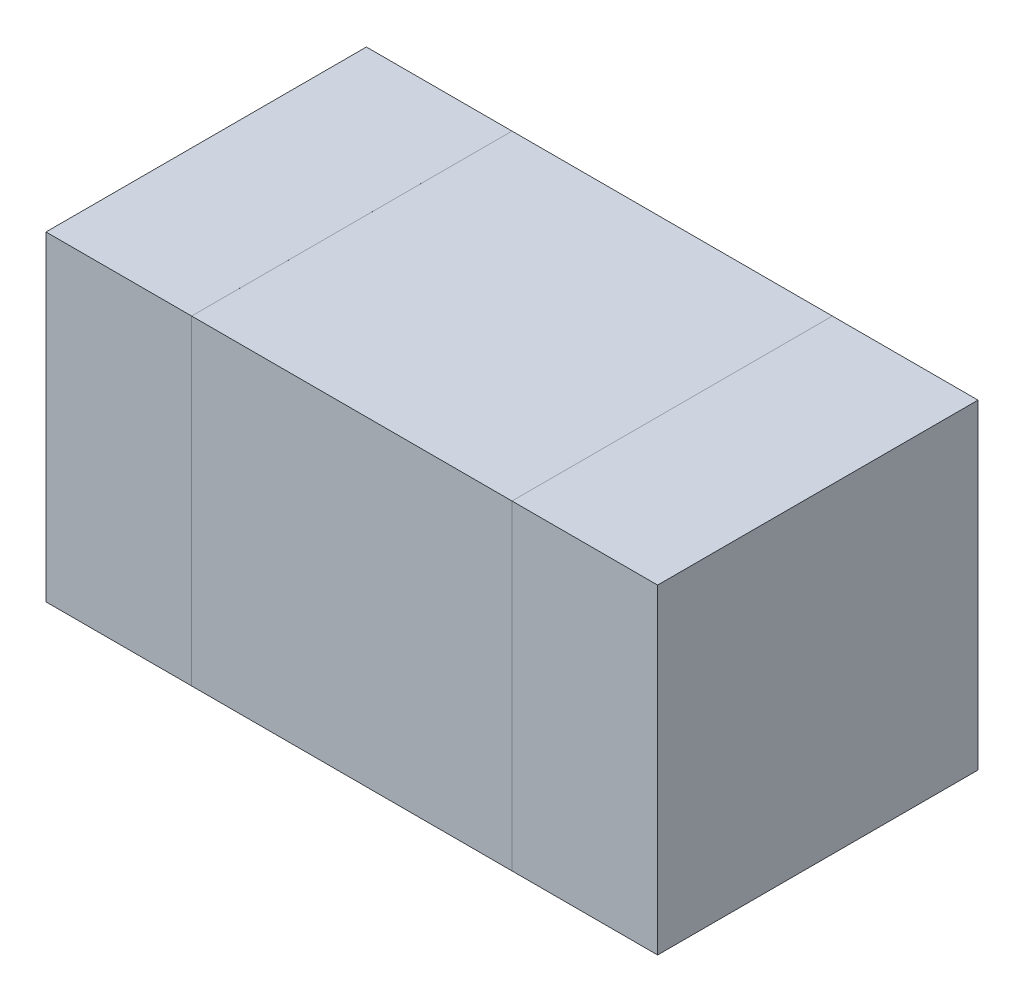
ISO-10303-21;
HEADER;
FILE_DESCRIPTION(('STEP AP214'),'2;1');
FILE_NAME('part.step','',(''),(''),'','','');
FILE_SCHEMA(('AUTOMOTIVE_DESIGN { 1 0 10303 214 1 1 1 1 }'));
ENDSEC;
DATA;
#1=APPLICATION_CONTEXT('core data for automotive mechanical design processes');
#2=APPLICATION_PROTOCOL_DEFINITION('international standard','automotive_design',2000,#1);
#3=PRODUCT_CONTEXT('',#1,'mechanical');
#4=PRODUCT('Part','Part','',(#3));
#5=PRODUCT_RELATED_PRODUCT_CATEGORY('part','',(#4));
#6=PRODUCT_DEFINITION_FORMATION('','',#4);
#7=PRODUCT_DEFINITION_CONTEXT('part definition',#1,'design');
#8=PRODUCT_DEFINITION('design','',#6,#7);
#9=PRODUCT_DEFINITION_SHAPE('','',#8);
#10=(LENGTH_UNIT() NAMED_UNIT(*) SI_UNIT(.MILLI.,.METRE.));
#11=(NAMED_UNIT(*) PLANE_ANGLE_UNIT() SI_UNIT($,.RADIAN.));
#12=(NAMED_UNIT(*) SI_UNIT($,.STERADIAN.) SOLID_ANGLE_UNIT());
#13=UNCERTAINTY_MEASURE_WITH_UNIT(LENGTH_MEASURE(1.E-05),#10,'distance_accuracy_value','');
#14=(GEOMETRIC_REPRESENTATION_CONTEXT(3) GLOBAL_UNCERTAINTY_ASSIGNED_CONTEXT((#13)) GLOBAL_UNIT_ASSIGNED_CONTEXT((#10,
#11,#12)) REPRESENTATION_CONTEXT('',''));
#15=CARTESIAN_POINT('',(0.,0.,0.));
#16=DIRECTION('',(0.,0.,1.));
#17=DIRECTION('',(1.,0.,0.));
#18=AXIS2_PLACEMENT_3D('',#15,#16,#17);
#19=CARTESIAN_POINT('',(9.060006232969,9.285003011953,0.32999934));
#20=DIRECTION('',(0.,0.,-1.));
#21=DIRECTION('',(0.,-1.,0.));
#22=AXIS2_PLACEMENT_3D('',#19,#20,#21);
#23=PLANE('',#22);
#24=DIRECTION('',(1.,0.,0.));
#25=VECTOR('',#24,1.);
#26=CARTESIAN_POINT('',(9.060006232969,9.285003011953,0.32999934));
#27=LINE('',#26,#25);
#28=CARTESIAN_POINT('',(9.060006232969,9.285003011953,0.32999934));
#29=VERTEX_POINT('',#28);
#30=CARTESIAN_POINT('',(9.390008112969,9.285003011953,0.32999934));
#31=VERTEX_POINT('',#30);
#32=EDGE_CURVE('P0_E90',#29,#31,#27,.T.);
#33=ORIENTED_EDGE('',*,*,#32,.T.);
#34=DIRECTION('',(0.,1.,0.));
#35=VECTOR('',#34,1.);
#36=CARTESIAN_POINT('',(9.390008112969,9.285003011953,0.32999934));
#37=LINE('',#36,#35);
#38=CARTESIAN_POINT('',(9.390008112969,9.615002351953,0.32999934));
#39=VERTEX_POINT('',#38);
#40=EDGE_CURVE('P0_E109',#31,#39,#37,.T.);
#41=ORIENTED_EDGE('',*,*,#40,.T.);
#42=DIRECTION('',(-1.,0.,0.));
#43=VECTOR('',#42,1.);
#44=CARTESIAN_POINT('',(9.390008112969,9.615002351953,0.32999934));
#45=LINE('',#44,#43);
#46=CARTESIAN_POINT('',(9.060006232969,9.615002351953,0.32999934));
#47=VERTEX_POINT('',#46);
#48=EDGE_CURVE('P0_E84',#39,#47,#45,.T.);
#49=ORIENTED_EDGE('',*,*,#48,.T.);
#50=DIRECTION('',(0.,-1.,0.));
#51=VECTOR('',#50,1.);
#52=CARTESIAN_POINT('',(9.060006232969,9.615002351953,0.32999934));
#53=LINE('',#52,#51);
#54=EDGE_CURVE('P0_E11',#47,#29,#53,.T.);
#55=ORIENTED_EDGE('',*,*,#54,.T.);
#56=EDGE_LOOP('',(#33,#41,#49,#55));
#57=FACE_BOUND('',#56,.T.);
#58=ADVANCED_FACE('P0_F17',(#57),#23,.F.);
#59=CARTESIAN_POINT('',(9.060006232969,9.285003011953,0.));
#60=DIRECTION('',(0.,0.,-1.));
#61=DIRECTION('',(0.,-1.,0.));
#62=AXIS2_PLACEMENT_3D('',#59,#60,#61);
#63=PLANE('',#62);
#64=DIRECTION('',(0.,-1.,0.));
#65=VECTOR('',#64,1.);
#66=CARTESIAN_POINT('',(9.060006232969,9.615002351953,0.));
#67=LINE('',#66,#65);
#68=CARTESIAN_POINT('',(9.060006232969,9.615002351953,0.));
#69=VERTEX_POINT('',#68);
#70=CARTESIAN_POINT('',(9.060006232969,9.285003011953,0.));
#71=VERTEX_POINT('',#70);
#72=EDGE_CURVE('P0_E25',#69,#71,#67,.T.);
#73=ORIENTED_EDGE('',*,*,#72,.F.);
#74=DIRECTION('',(-1.,0.,0.));
#75=VECTOR('',#74,1.);
#76=CARTESIAN_POINT('',(9.390008112969,9.615002351953,0.));
#77=LINE('',#76,#75);
#78=CARTESIAN_POINT('',(9.390008112969,9.615002351953,0.));
#79=VERTEX_POINT('',#78);
#80=EDGE_CURVE('P0_E63',#79,#69,#77,.T.);
#81=ORIENTED_EDGE('',*,*,#80,.F.);
#82=DIRECTION('',(0.,1.,0.));
#83=VECTOR('',#82,1.);
#84=CARTESIAN_POINT('',(9.390008112969,9.285003011953,0.));
#85=LINE('',#84,#83);
#86=CARTESIAN_POINT('',(9.390008112969,9.285003011953,0.));
#87=VERTEX_POINT('',#86);
#88=EDGE_CURVE('P0_E74',#87,#79,#85,.T.);
#89=ORIENTED_EDGE('',*,*,#88,.F.);
#90=DIRECTION('',(1.,0.,0.));
#91=VECTOR('',#90,1.);
#92=CARTESIAN_POINT('',(9.060006232969,9.285003011953,0.));
#93=LINE('',#92,#91);
#94=EDGE_CURVE('P0_E89',#71,#87,#93,.T.);
#95=ORIENTED_EDGE('',*,*,#94,.F.);
#96=EDGE_LOOP('',(#73,#81,#89,#95));
#97=FACE_BOUND('',#96,.T.);
#98=ADVANCED_FACE('P0_F93',(#97),#63,.T.);
#99=CARTESIAN_POINT('',(9.060006232969,9.615002351953,0.));
#100=DIRECTION('',(1.,0.,0.));
#101=DIRECTION('',(0.,1.,0.));
#102=AXIS2_PLACEMENT_3D('',#99,#100,#101);
#103=PLANE('',#102);
#104=ORIENTED_EDGE('',*,*,#72,.T.);
#105=DIRECTION('',(0.,0.,1.));
#106=VECTOR('',#105,1.);
#107=CARTESIAN_POINT('',(9.060006232969,9.285003011953,0.));
#108=LINE('',#107,#106);
#109=EDGE_CURVE('P0_E79',#71,#29,#108,.T.);
#110=ORIENTED_EDGE('',*,*,#109,.T.);
#111=ORIENTED_EDGE('',*,*,#54,.F.);
#112=DIRECTION('',(0.,0.,1.));
#113=VECTOR('',#112,1.);
#114=CARTESIAN_POINT('',(9.060006232969,9.615002351953,0.));
#115=LINE('',#114,#113);
#116=EDGE_CURVE('P0_E82',#69,#47,#115,.T.);
#117=ORIENTED_EDGE('',*,*,#116,.F.);
#118=EDGE_LOOP('',(#104,#110,#111,#117));
#119=FACE_BOUND('',#118,.T.);
#120=ADVANCED_FACE('P0_F78',(#119),#103,.F.);
#121=CARTESIAN_POINT('',(9.390008112969,9.615002351953,0.));
#122=DIRECTION('',(0.,-1.,0.));
#123=DIRECTION('',(0.,0.,-1.));
#124=AXIS2_PLACEMENT_3D('',#121,#122,#123);
#125=PLANE('',#124);
#126=ORIENTED_EDGE('',*,*,#80,.T.);
#127=ORIENTED_EDGE('',*,*,#116,.T.);
#128=ORIENTED_EDGE('',*,*,#48,.F.);
#129=DIRECTION('',(0.,0.,1.));
#130=VECTOR('',#129,1.);
#131=CARTESIAN_POINT('',(9.390008112969,9.615002351953,0.));
#132=LINE('',#131,#130);
#133=EDGE_CURVE('P0_E105',#79,#39,#132,.T.);
#134=ORIENTED_EDGE('',*,*,#133,.F.);
#135=EDGE_LOOP('',(#126,#127,#128,#134));
#136=FACE_BOUND('',#135,.T.);
#137=ADVANCED_FACE('P0_F120',(#136),#125,.F.);
#138=CARTESIAN_POINT('',(9.390008112969,9.285003011953,0.));
#139=DIRECTION('',(-1.,0.,0.));
#140=DIRECTION('',(0.,0.,1.));
#141=AXIS2_PLACEMENT_3D('',#138,#139,#140);
#142=PLANE('',#141);
#143=ORIENTED_EDGE('',*,*,#88,.T.);
#144=ORIENTED_EDGE('',*,*,#133,.T.);
#145=ORIENTED_EDGE('',*,*,#40,.F.);
#146=DIRECTION('',(0.,0.,1.));
#147=VECTOR('',#146,1.);
#148=CARTESIAN_POINT('',(9.390008112969,9.285003011953,0.));
#149=LINE('',#148,#147);
#150=EDGE_CURVE('P0_E95',#87,#31,#149,.T.);
#151=ORIENTED_EDGE('',*,*,#150,.F.);
#152=EDGE_LOOP('',(#143,#144,#145,#151));
#153=FACE_BOUND('',#152,.T.);
#154=ADVANCED_FACE('P0_F122',(#153),#142,.F.);
#155=CARTESIAN_POINT('',(9.060006232969,9.285003011953,0.));
#156=DIRECTION('',(0.,1.,0.));
#157=DIRECTION('',(1.,0.,0.));
#158=AXIS2_PLACEMENT_3D('',#155,#156,#157);
#159=PLANE('',#158);
#160=ORIENTED_EDGE('',*,*,#94,.T.);
#161=ORIENTED_EDGE('',*,*,#150,.T.);
#162=ORIENTED_EDGE('',*,*,#32,.F.);
#163=ORIENTED_EDGE('',*,*,#109,.F.);
#164=EDGE_LOOP('',(#160,#161,#162,#163));
#165=FACE_BOUND('',#164,.T.);
#166=ADVANCED_FACE('P0_F87',(#165),#159,.F.);
#167=CLOSED_SHELL('',(#58,#98,#120,#137,#154,#166));
#168=MANIFOLD_SOLID_BREP('P0_B1',#167);
#169=CARTESIAN_POINT('',(9.060002799805,9.285000471953,0.32999934));
#170=DIRECTION('',(0.,0.,-1.));
#171=DIRECTION('',(0.,-1.,0.));
#172=AXIS2_PLACEMENT_3D('',#169,#170,#171);
#173=PLANE('',#172);
#174=DIRECTION('',(0.,1.,0.));
#175=VECTOR('',#174,1.);
#176=CARTESIAN_POINT('',(9.060002799805,9.285000471953,0.32999934));
#177=LINE('',#176,#175);
#178=CARTESIAN_POINT('',(9.060002799805,9.285000471953,0.32999934));
#179=VERTEX_POINT('',#178);
#180=CARTESIAN_POINT('',(9.060002799805,9.615002351953,0.32999934));
#181=VERTEX_POINT('',#180);
#182=EDGE_CURVE('P1_E81',#179,#181,#177,.T.);
#183=ORIENTED_EDGE('',*,*,#182,.T.);
#184=DIRECTION('',(-1.,0.,0.));
#185=VECTOR('',#184,1.);
#186=CARTESIAN_POINT('',(9.060002799805,9.615002351953,0.32999934));
#187=LINE('',#186,#185);
#188=CARTESIAN_POINT('',(8.910000559805,9.615002351953,0.32999934));
#189=VERTEX_POINT('',#188);
#190=EDGE_CURVE('P1_E79',#181,#189,#187,.T.);
#191=ORIENTED_EDGE('',*,*,#190,.T.);
#192=DIRECTION('',(0.,-1.,0.));
#193=VECTOR('',#192,1.);
#194=CARTESIAN_POINT('',(8.910000559805,9.615002351953,0.32999934));
#195=LINE('',#194,#193);
#196=CARTESIAN_POINT('',(8.910000559805,9.285000471953,0.32999934));
#197=VERTEX_POINT('',#196);
#198=EDGE_CURVE('P1_E68',#189,#197,#195,.T.);
#199=ORIENTED_EDGE('',*,*,#198,.T.);
#200=DIRECTION('',(1.,0.,0.));
#201=VECTOR('',#200,1.);
#202=CARTESIAN_POINT('',(8.910000559805,9.285000471953,0.32999934));
#203=LINE('',#202,#201);
#204=EDGE_CURVE('P1_E11',#197,#179,#203,.T.);
#205=ORIENTED_EDGE('',*,*,#204,.T.);
#206=EDGE_LOOP('',(#183,#191,#199,#205));
#207=FACE_BOUND('',#206,.T.);
#208=ADVANCED_FACE('P1_F17',(#207),#173,.F.);
#209=CARTESIAN_POINT('',(9.060002799805,9.285000471953,0.));
#210=DIRECTION('',(0.,0.,-1.));
#211=DIRECTION('',(0.,-1.,0.));
#212=AXIS2_PLACEMENT_3D('',#209,#210,#211);
#213=PLANE('',#212);
#214=DIRECTION('',(1.,0.,0.));
#215=VECTOR('',#214,1.);
#216=CARTESIAN_POINT('',(8.910000559805,9.285000471953,0.));
#217=LINE('',#216,#215);
#218=CARTESIAN_POINT('',(8.910000559805,9.285000471953,0.));
#219=VERTEX_POINT('',#218);
#220=CARTESIAN_POINT('',(9.060002799805,9.285000471953,0.));
#221=VERTEX_POINT('',#220);
#222=EDGE_CURVE('P1_E21',#219,#221,#217,.T.);
#223=ORIENTED_EDGE('',*,*,#222,.F.);
#224=DIRECTION('',(0.,-1.,0.));
#225=VECTOR('',#224,1.);
#226=CARTESIAN_POINT('',(8.910000559805,9.615002351953,0.));
#227=LINE('',#226,#225);
#228=CARTESIAN_POINT('',(8.910000559805,9.615002351953,0.));
#229=VERTEX_POINT('',#228);
#230=EDGE_CURVE('P1_E61',#229,#219,#227,.T.);
#231=ORIENTED_EDGE('',*,*,#230,.F.);
#232=DIRECTION('',(-1.,0.,0.));
#233=VECTOR('',#232,1.);
#234=CARTESIAN_POINT('',(9.060002799805,9.615002351953,0.));
#235=LINE('',#234,#233);
#236=CARTESIAN_POINT('',(9.060002799805,9.615002351953,0.));
#237=VERTEX_POINT('',#236);
#238=EDGE_CURVE('P1_E88',#237,#229,#235,.T.);
#239=ORIENTED_EDGE('',*,*,#238,.F.);
#240=DIRECTION('',(0.,1.,0.));
#241=VECTOR('',#240,1.);
#242=CARTESIAN_POINT('',(9.060002799805,9.285000471953,0.));
#243=LINE('',#242,#241);
#244=EDGE_CURVE('P1_E150',#221,#237,#243,.T.);
#245=ORIENTED_EDGE('',*,*,#244,.F.);
#246=EDGE_LOOP('',(#223,#231,#239,#245));
#247=FACE_BOUND('',#246,.T.);
#248=ADVANCED_FACE('P1_F19',(#247),#213,.T.);
#249=CARTESIAN_POINT('',(8.910000559805,9.285000471953,0.));
#250=DIRECTION('',(0.,1.,0.));
#251=DIRECTION('',(1.,0.,0.));
#252=AXIS2_PLACEMENT_3D('',#249,#250,#251);
#253=PLANE('',#252);
#254=ORIENTED_EDGE('',*,*,#222,.T.);
#255=DIRECTION('',(0.,0.,1.));
#256=VECTOR('',#255,1.);
#257=CARTESIAN_POINT('',(9.060002799805,9.285000471953,0.));
#258=LINE('',#257,#256);
#259=EDGE_CURVE('P1_E94',#221,#179,#258,.T.);
#260=ORIENTED_EDGE('',*,*,#259,.T.);
#261=ORIENTED_EDGE('',*,*,#204,.F.);
#262=DIRECTION('',(0.,0.,1.));
#263=VECTOR('',#262,1.);
#264=CARTESIAN_POINT('',(8.910000559805,9.285000471953,0.));
#265=LINE('',#264,#263);
#266=EDGE_CURVE('P1_E74',#219,#197,#265,.T.);
#267=ORIENTED_EDGE('',*,*,#266,.F.);
#268=EDGE_LOOP('',(#254,#260,#261,#267));
#269=FACE_BOUND('',#268,.T.);
#270=ADVANCED_FACE('P1_F132',(#269),#253,.F.);
#271=CARTESIAN_POINT('',(8.910000559805,9.615002351953,0.));
#272=DIRECTION('',(1.,0.,0.));
#273=DIRECTION('',(0.,1.,0.));
#274=AXIS2_PLACEMENT_3D('',#271,#272,#273);
#275=PLANE('',#274);
#276=ORIENTED_EDGE('',*,*,#230,.T.);
#277=ORIENTED_EDGE('',*,*,#266,.T.);
#278=ORIENTED_EDGE('',*,*,#198,.F.);
#279=DIRECTION('',(0.,0.,1.));
#280=VECTOR('',#279,1.);
#281=CARTESIAN_POINT('',(8.910000559805,9.615002351953,0.));
#282=LINE('',#281,#280);
#283=EDGE_CURVE('P1_E72',#229,#189,#282,.T.);
#284=ORIENTED_EDGE('',*,*,#283,.F.);
#285=EDGE_LOOP('',(#276,#277,#278,#284));
#286=FACE_BOUND('',#285,.T.);
#287=ADVANCED_FACE('P1_F70',(#286),#275,.F.);
#288=CARTESIAN_POINT('',(9.060002799805,9.615002351953,0.));
#289=DIRECTION('',(0.,-1.,0.));
#290=DIRECTION('',(0.,0.,-1.));
#291=AXIS2_PLACEMENT_3D('',#288,#289,#290);
#292=PLANE('',#291);
#293=ORIENTED_EDGE('',*,*,#238,.T.);
#294=ORIENTED_EDGE('',*,*,#283,.T.);
#295=ORIENTED_EDGE('',*,*,#190,.F.);
#296=DIRECTION('',(0.,0.,1.));
#297=VECTOR('',#296,1.);
#298=CARTESIAN_POINT('',(9.060002799805,9.615002351953,0.));
#299=LINE('',#298,#297);
#300=EDGE_CURVE('P1_E151',#237,#181,#299,.T.);
#301=ORIENTED_EDGE('',*,*,#300,.F.);
#302=EDGE_LOOP('',(#293,#294,#295,#301));
#303=FACE_BOUND('',#302,.T.);
#304=ADVANCED_FACE('P1_F87',(#303),#292,.F.);
#305=CARTESIAN_POINT('',(9.060002799805,9.285000471953,0.));
#306=DIRECTION('',(-1.,0.,0.));
#307=DIRECTION('',(0.,0.,1.));
#308=AXIS2_PLACEMENT_3D('',#305,#306,#307);
#309=PLANE('',#308);
#310=ORIENTED_EDGE('',*,*,#244,.T.);
#311=ORIENTED_EDGE('',*,*,#300,.T.);
#312=ORIENTED_EDGE('',*,*,#182,.F.);
#313=ORIENTED_EDGE('',*,*,#259,.F.);
#314=EDGE_LOOP('',(#310,#311,#312,#313));
#315=FACE_BOUND('',#314,.T.);
#316=ADVANCED_FACE('P1_F107',(#315),#309,.F.);
#317=CLOSED_SHELL('',(#208,#248,#270,#287,#304,#316));
#318=MANIFOLD_SOLID_BREP('P1_B1',#317);
#319=CARTESIAN_POINT('',(9.539998527344,9.285000471953,0.32999934));
#320=DIRECTION('',(0.,0.,-1.));
#321=DIRECTION('',(0.,-1.,0.));
#322=AXIS2_PLACEMENT_3D('',#319,#320,#321);
#323=PLANE('',#322);
#324=DIRECTION('',(0.,1.,0.));
#325=VECTOR('',#324,1.);
#326=CARTESIAN_POINT('',(9.539998527344,9.285000471953,0.32999934));
#327=LINE('',#326,#325);
#328=CARTESIAN_POINT('',(9.539998527344,9.285000471953,0.32999934));
#329=VERTEX_POINT('',#328);
#330=CARTESIAN_POINT('',(9.539998527344,9.615002351953,0.32999934));
#331=VERTEX_POINT('',#330);
#332=EDGE_CURVE('P2_E83',#329,#331,#327,.T.);
#333=ORIENTED_EDGE('',*,*,#332,.T.);
#334=DIRECTION('',(-1.,0.,0.));
#335=VECTOR('',#334,1.);
#336=CARTESIAN_POINT('',(9.539998527344,9.615002351953,0.32999934));
#337=LINE('',#336,#335);
#338=CARTESIAN_POINT('',(9.389996287344,9.615002351953,0.32999934));
#339=VERTEX_POINT('',#338);
#340=EDGE_CURVE('P2_E104',#331,#339,#337,.T.);
#341=ORIENTED_EDGE('',*,*,#340,.T.);
#342=DIRECTION('',(0.,-1.,0.));
#343=VECTOR('',#342,1.);
#344=CARTESIAN_POINT('',(9.389996287344,9.615002351953,0.32999934));
#345=LINE('',#344,#343);
#346=CARTESIAN_POINT('',(9.389996287344,9.285000471953,0.32999934));
#347=VERTEX_POINT('',#346);
#348=EDGE_CURVE('P2_E20',#339,#347,#345,.T.);
#349=ORIENTED_EDGE('',*,*,#348,.T.);
#350=DIRECTION('',(1.,0.,0.));
#351=VECTOR('',#350,1.);
#352=CARTESIAN_POINT('',(9.389996287344,9.285000471953,0.32999934));
#353=LINE('',#352,#351);
#354=EDGE_CURVE('P2_E11',#347,#329,#353,.T.);
#355=ORIENTED_EDGE('',*,*,#354,.T.);
#356=EDGE_LOOP('',(#333,#341,#349,#355));
#357=FACE_BOUND('',#356,.T.);
#358=ADVANCED_FACE('P2_F17',(#357),#323,.F.);
#359=CARTESIAN_POINT('',(9.539998527344,9.285000471953,0.));
#360=DIRECTION('',(0.,0.,-1.));
#361=DIRECTION('',(0.,-1.,0.));
#362=AXIS2_PLACEMENT_3D('',#359,#360,#361);
#363=PLANE('',#362);
#364=DIRECTION('',(1.,0.,0.));
#365=VECTOR('',#364,1.);
#366=CARTESIAN_POINT('',(9.389996287344,9.285000471953,0.));
#367=LINE('',#366,#365);
#368=CARTESIAN_POINT('',(9.389996287344,9.285000471953,0.));
#369=VERTEX_POINT('',#368);
#370=CARTESIAN_POINT('',(9.539998527344,9.285000471953,0.));
#371=VERTEX_POINT('',#370);
#372=EDGE_CURVE('P2_E26',#369,#371,#367,.T.);
#373=ORIENTED_EDGE('',*,*,#372,.F.);
#374=DIRECTION('',(0.,-1.,0.));
#375=VECTOR('',#374,1.);
#376=CARTESIAN_POINT('',(9.389996287344,9.615002351953,0.));
#377=LINE('',#376,#375);
#378=CARTESIAN_POINT('',(9.389996287344,9.615002351953,0.));
#379=VERTEX_POINT('',#378);
#380=EDGE_CURVE('P2_E101',#379,#369,#377,.T.);
#381=ORIENTED_EDGE('',*,*,#380,.F.);
#382=DIRECTION('',(-1.,0.,0.));
#383=VECTOR('',#382,1.);
#384=CARTESIAN_POINT('',(9.539998527344,9.615002351953,0.));
#385=LINE('',#384,#383);
#386=CARTESIAN_POINT('',(9.539998527344,9.615002351953,0.));
#387=VERTEX_POINT('',#386);
#388=EDGE_CURVE('P2_E85',#387,#379,#385,.T.);
#389=ORIENTED_EDGE('',*,*,#388,.F.);
#390=DIRECTION('',(0.,1.,0.));
#391=VECTOR('',#390,1.);
#392=CARTESIAN_POINT('',(9.539998527344,9.285000471953,0.));
#393=LINE('',#392,#391);
#394=EDGE_CURVE('P2_E81',#371,#387,#393,.T.);
#395=ORIENTED_EDGE('',*,*,#394,.F.);
#396=EDGE_LOOP('',(#373,#381,#389,#395));
#397=FACE_BOUND('',#396,.T.);
#398=ADVANCED_FACE('P2_F87',(#397),#363,.T.);
#399=CARTESIAN_POINT('',(9.389996287344,9.285000471953,0.));
#400=DIRECTION('',(0.,1.,0.));
#401=DIRECTION('',(1.,0.,0.));
#402=AXIS2_PLACEMENT_3D('',#399,#400,#401);
#403=PLANE('',#402);
#404=ORIENTED_EDGE('',*,*,#372,.T.);
#405=DIRECTION('',(0.,0.,1.));
#406=VECTOR('',#405,1.);
#407=CARTESIAN_POINT('',(9.539998527344,9.285000471953,0.));
#408=LINE('',#407,#406);
#409=EDGE_CURVE('P2_E70',#371,#329,#408,.T.);
#410=ORIENTED_EDGE('',*,*,#409,.T.);
#411=ORIENTED_EDGE('',*,*,#354,.F.);
#412=DIRECTION('',(0.,0.,1.));
#413=VECTOR('',#412,1.);
#414=CARTESIAN_POINT('',(9.389996287344,9.285000471953,0.));
#415=LINE('',#414,#413);
#416=EDGE_CURVE('P2_E73',#369,#347,#415,.T.);
#417=ORIENTED_EDGE('',*,*,#416,.F.);
#418=EDGE_LOOP('',(#404,#410,#411,#417));
#419=FACE_BOUND('',#418,.T.);
#420=ADVANCED_FACE('P2_F69',(#419),#403,.F.);
#421=CARTESIAN_POINT('',(9.389996287344,9.615002351953,0.));
#422=DIRECTION('',(1.,0.,0.));
#423=DIRECTION('',(0.,1.,0.));
#424=AXIS2_PLACEMENT_3D('',#421,#422,#423);
#425=PLANE('',#424);
#426=ORIENTED_EDGE('',*,*,#380,.T.);
#427=ORIENTED_EDGE('',*,*,#416,.T.);
#428=ORIENTED_EDGE('',*,*,#348,.F.);
#429=DIRECTION('',(0.,0.,1.));
#430=VECTOR('',#429,1.);
#431=CARTESIAN_POINT('',(9.389996287344,9.615002351953,0.));
#432=LINE('',#431,#430);
#433=EDGE_CURVE('P2_E107',#379,#339,#432,.T.);
#434=ORIENTED_EDGE('',*,*,#433,.F.);
#435=EDGE_LOOP('',(#426,#427,#428,#434));
#436=FACE_BOUND('',#435,.T.);
#437=ADVANCED_FACE('P2_F119',(#436),#425,.F.);
#438=CARTESIAN_POINT('',(9.539998527344,9.615002351953,0.));
#439=DIRECTION('',(0.,-1.,0.));
#440=DIRECTION('',(0.,0.,-1.));
#441=AXIS2_PLACEMENT_3D('',#438,#439,#440);
#442=PLANE('',#441);
#443=ORIENTED_EDGE('',*,*,#388,.T.);
#444=ORIENTED_EDGE('',*,*,#433,.T.);
#445=ORIENTED_EDGE('',*,*,#340,.F.);
#446=DIRECTION('',(0.,0.,1.));
#447=VECTOR('',#446,1.);
#448=CARTESIAN_POINT('',(9.539998527344,9.615002351953,0.));
#449=LINE('',#448,#447);
#450=EDGE_CURVE('P2_E91',#387,#331,#449,.T.);
#451=ORIENTED_EDGE('',*,*,#450,.F.);
#452=EDGE_LOOP('',(#443,#444,#445,#451));
#453=FACE_BOUND('',#452,.T.);
#454=ADVANCED_FACE('P2_F117',(#453),#442,.F.);
#455=CARTESIAN_POINT('',(9.539998527344,9.285000471953,0.));
#456=DIRECTION('',(-1.,0.,0.));
#457=DIRECTION('',(0.,0.,1.));
#458=AXIS2_PLACEMENT_3D('',#455,#456,#457);
#459=PLANE('',#458);
#460=ORIENTED_EDGE('',*,*,#394,.T.);
#461=ORIENTED_EDGE('',*,*,#450,.T.);
#462=ORIENTED_EDGE('',*,*,#332,.F.);
#463=ORIENTED_EDGE('',*,*,#409,.F.);
#464=EDGE_LOOP('',(#460,#461,#462,#463));
#465=FACE_BOUND('',#464,.T.);
#466=ADVANCED_FACE('P2_F79',(#465),#459,.F.);
#467=CLOSED_SHELL('',(#358,#398,#420,#437,#454,#466));
#468=MANIFOLD_SOLID_BREP('P2_B1',#467);
#469=ADVANCED_BREP_SHAPE_REPRESENTATION('',(#18,#168,#318,#468),#14);
#470=SHAPE_DEFINITION_REPRESENTATION(#9,#469);
ENDSEC;
END-ISO-10303-21;
